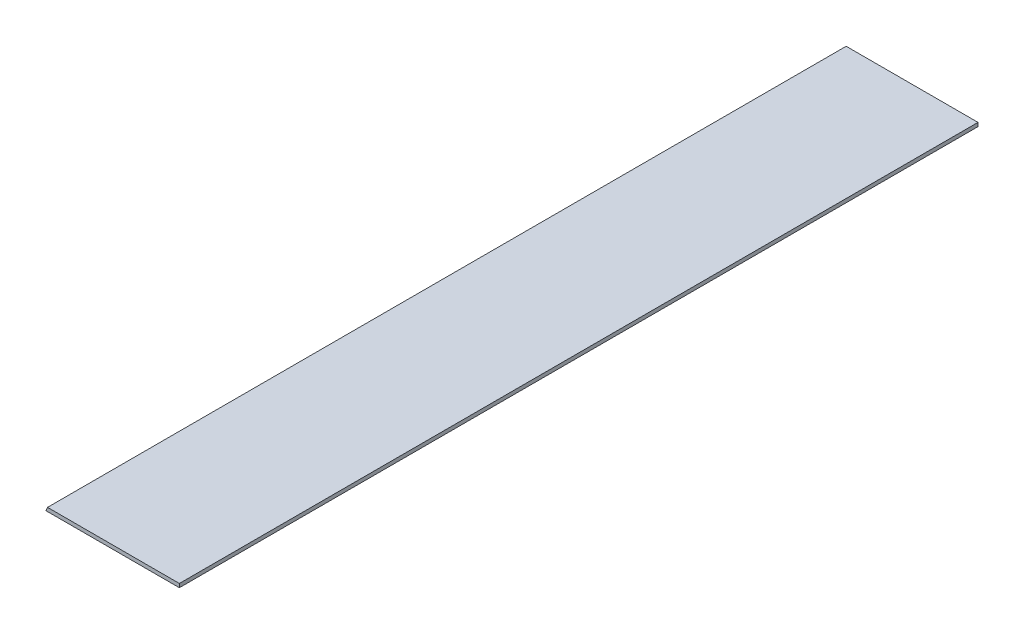
ISO-10303-21;
HEADER;
FILE_DESCRIPTION(('STEP AP214'),'2;1');
FILE_NAME('part.step','',(''),(''),'','','');
FILE_SCHEMA(('AUTOMOTIVE_DESIGN { 1 0 10303 214 1 1 1 1 }'));
ENDSEC;
DATA;
#1=APPLICATION_CONTEXT('core data for automotive mechanical design processes');
#2=APPLICATION_PROTOCOL_DEFINITION('international standard','automotive_design',2000,#1);
#3=PRODUCT_CONTEXT('',#1,'mechanical');
#4=PRODUCT('Part','Part','',(#3));
#5=PRODUCT_RELATED_PRODUCT_CATEGORY('part','',(#4));
#6=PRODUCT_DEFINITION_FORMATION('','',#4);
#7=PRODUCT_DEFINITION_CONTEXT('part definition',#1,'design');
#8=PRODUCT_DEFINITION('design','',#6,#7);
#9=PRODUCT_DEFINITION_SHAPE('','',#8);
#10=(LENGTH_UNIT() NAMED_UNIT(*) SI_UNIT(.MILLI.,.METRE.));
#11=(NAMED_UNIT(*) PLANE_ANGLE_UNIT() SI_UNIT($,.RADIAN.));
#12=(NAMED_UNIT(*) SI_UNIT($,.STERADIAN.) SOLID_ANGLE_UNIT());
#13=UNCERTAINTY_MEASURE_WITH_UNIT(LENGTH_MEASURE(1.E-05),#10,'distance_accuracy_value','');
#14=(GEOMETRIC_REPRESENTATION_CONTEXT(3) GLOBAL_UNCERTAINTY_ASSIGNED_CONTEXT((#13)) GLOBAL_UNIT_ASSIGNED_CONTEXT((#10,
#11,#12)) REPRESENTATION_CONTEXT('',''));
#15=CARTESIAN_POINT('',(0.,0.,0.));
#16=DIRECTION('',(0.,0.,1.));
#17=DIRECTION('',(1.,0.,0.));
#18=AXIS2_PLACEMENT_3D('',#15,#16,#17);
#19=CARTESIAN_POINT('',(84.836,0.,508.));
#20=DIRECTION('',(0.,1.,0.));
#21=DIRECTION('',(-1.,0.,0.));
#22=AXIS2_PLACEMENT_3D('',#19,#20,#21);
#23=PLANE('',#22);
#24=DIRECTION('',(1.,0.,0.));
#25=VECTOR('',#24,1.);
#26=CARTESIAN_POINT('',(84.836,0.,0.));
#27=LINE('',#26,#25);
#28=CARTESIAN_POINT('',(0.,0.,0.));
#29=VERTEX_POINT('',#28);
#30=CARTESIAN_POINT('',(84.836,0.,0.));
#31=VERTEX_POINT('',#30);
#32=EDGE_CURVE('E98',#29,#31,#27,.T.);
#33=ORIENTED_EDGE('',*,*,#32,.T.);
#34=DIRECTION('',(0.,0.,-1.));
#35=VECTOR('',#34,1.);
#36=CARTESIAN_POINT('',(84.836,0.,508.));
#37=LINE('',#36,#35);
#38=CARTESIAN_POINT('',(84.836,0.,508.));
#39=VERTEX_POINT('',#38);
#40=EDGE_CURVE('E11',#39,#31,#37,.T.);
#41=ORIENTED_EDGE('',*,*,#40,.F.);
#42=DIRECTION('',(1.,0.,0.));
#43=VECTOR('',#42,1.);
#44=CARTESIAN_POINT('',(84.836,0.,508.));
#45=LINE('',#44,#43);
#46=CARTESIAN_POINT('',(0.,0.,508.));
#47=VERTEX_POINT('',#46);
#48=EDGE_CURVE('E86',#47,#39,#45,.T.);
#49=ORIENTED_EDGE('',*,*,#48,.F.);
#50=DIRECTION('',(0.,0.,-1.));
#51=VECTOR('',#50,1.);
#52=CARTESIAN_POINT('',(0.,0.,508.));
#53=LINE('',#52,#51);
#54=EDGE_CURVE('E94',#47,#29,#53,.T.);
#55=ORIENTED_EDGE('',*,*,#54,.T.);
#56=EDGE_LOOP('',(#33,#41,#49,#55));
#57=FACE_BOUND('',#56,.T.);
#58=ADVANCED_FACE('F35',(#57),#23,.F.);
#59=CARTESIAN_POINT('',(84.836,2.3622,508.));
#60=DIRECTION('',(-1.,0.,0.));
#61=DIRECTION('',(0.,0.,1.));
#62=AXIS2_PLACEMENT_3D('',#59,#60,#61);
#63=PLANE('',#62);
#64=DIRECTION('',(0.,1.,0.));
#65=VECTOR('',#64,1.);
#66=CARTESIAN_POINT('',(84.836,2.3622,0.));
#67=LINE('',#66,#65);
#68=CARTESIAN_POINT('',(84.836,2.3622,0.));
#69=VERTEX_POINT('',#68);
#70=EDGE_CURVE('E90',#31,#69,#67,.T.);
#71=ORIENTED_EDGE('',*,*,#70,.T.);
#72=DIRECTION('',(0.,0.,-1.));
#73=VECTOR('',#72,1.);
#74=CARTESIAN_POINT('',(84.836,2.3622,508.));
#75=LINE('',#74,#73);
#76=CARTESIAN_POINT('',(84.836,2.3622,508.));
#77=VERTEX_POINT('',#76);
#78=EDGE_CURVE('E43',#77,#69,#75,.T.);
#79=ORIENTED_EDGE('',*,*,#78,.F.);
#80=DIRECTION('',(0.,1.,0.));
#81=VECTOR('',#80,1.);
#82=CARTESIAN_POINT('',(84.836,2.3622,508.));
#83=LINE('',#82,#81);
#84=EDGE_CURVE('E81',#39,#77,#83,.T.);
#85=ORIENTED_EDGE('',*,*,#84,.F.);
#86=ORIENTED_EDGE('',*,*,#40,.T.);
#87=EDGE_LOOP('',(#71,#79,#85,#86));
#88=FACE_BOUND('',#87,.T.);
#89=ADVANCED_FACE('F89',(#88),#63,.F.);
#90=CARTESIAN_POINT('',(0.978455277037737,2.3622,508.));
#91=DIRECTION('',(0.,-1.,0.));
#92=DIRECTION('',(1.,0.,0.));
#93=AXIS2_PLACEMENT_3D('',#90,#91,#92);
#94=PLANE('',#93);
#95=DIRECTION('',(-1.,0.,0.));
#96=VECTOR('',#95,1.);
#97=CARTESIAN_POINT('',(0.978455277037737,2.3622,0.));
#98=LINE('',#97,#96);
#99=CARTESIAN_POINT('',(0.978455277037737,2.3622,0.));
#100=VERTEX_POINT('',#99);
#101=EDGE_CURVE('E68',#69,#100,#98,.T.);
#102=ORIENTED_EDGE('',*,*,#101,.T.);
#103=DIRECTION('',(0.,0.,-1.));
#104=VECTOR('',#103,1.);
#105=CARTESIAN_POINT('',(0.978455277037737,2.3622,508.));
#106=LINE('',#105,#104);
#107=CARTESIAN_POINT('',(0.978455277037737,2.3622,508.));
#108=VERTEX_POINT('',#107);
#109=EDGE_CURVE('E91',#108,#100,#106,.T.);
#110=ORIENTED_EDGE('',*,*,#109,.F.);
#111=DIRECTION('',(-1.,0.,0.));
#112=VECTOR('',#111,1.);
#113=CARTESIAN_POINT('',(0.978455277037737,2.3622,508.));
#114=LINE('',#113,#112);
#115=EDGE_CURVE('E84',#77,#108,#114,.T.);
#116=ORIENTED_EDGE('',*,*,#115,.F.);
#117=ORIENTED_EDGE('',*,*,#78,.T.);
#118=EDGE_LOOP('',(#102,#110,#116,#117));
#119=FACE_BOUND('',#118,.T.);
#120=ADVANCED_FACE('F92',(#119),#94,.F.);
#121=CARTESIAN_POINT('',(0.,0.,508.));
#122=DIRECTION('',(0.923879532511285,-0.382683432365094,0.));
#123=DIRECTION('',(0.382683432365094,0.923879532511285,0.));
#124=AXIS2_PLACEMENT_3D('',#121,#122,#123);
#125=PLANE('',#124);
#126=DIRECTION('',(-0.382683432365094,-0.923879532511285,0.));
#127=VECTOR('',#126,1.);
#128=CARTESIAN_POINT('',(0.,0.,0.));
#129=LINE('',#128,#127);
#130=EDGE_CURVE('E74',#100,#29,#129,.T.);
#131=ORIENTED_EDGE('',*,*,#130,.T.);
#132=ORIENTED_EDGE('',*,*,#54,.F.);
#133=DIRECTION('',(-0.382683432365094,-0.923879532511285,0.));
#134=VECTOR('',#133,1.);
#135=CARTESIAN_POINT('',(0.,0.,508.));
#136=LINE('',#135,#134);
#137=EDGE_CURVE('E51',#108,#47,#136,.T.);
#138=ORIENTED_EDGE('',*,*,#137,.F.);
#139=ORIENTED_EDGE('',*,*,#109,.T.);
#140=EDGE_LOOP('',(#131,#132,#138,#139));
#141=FACE_BOUND('',#140,.T.);
#142=ADVANCED_FACE('F105',(#141),#125,.F.);
#143=CARTESIAN_POINT('',(0.,0.,508.));
#144=DIRECTION('',(0.,0.,1.));
#145=DIRECTION('',(1.,0.,0.));
#146=AXIS2_PLACEMENT_3D('',#143,#144,#145);
#147=PLANE('',#146);
#148=ORIENTED_EDGE('',*,*,#48,.T.);
#149=ORIENTED_EDGE('',*,*,#84,.T.);
#150=ORIENTED_EDGE('',*,*,#115,.T.);
#151=ORIENTED_EDGE('',*,*,#137,.T.);
#152=EDGE_LOOP('',(#148,#149,#150,#151));
#153=FACE_BOUND('',#152,.T.);
#154=ADVANCED_FACE('F82',(#153),#147,.T.);
#155=CARTESIAN_POINT('',(0.,0.,0.));
#156=DIRECTION('',(0.,0.,1.));
#157=DIRECTION('',(1.,0.,0.));
#158=AXIS2_PLACEMENT_3D('',#155,#156,#157);
#159=PLANE('',#158);
#160=ORIENTED_EDGE('',*,*,#32,.F.);
#161=ORIENTED_EDGE('',*,*,#130,.F.);
#162=ORIENTED_EDGE('',*,*,#101,.F.);
#163=ORIENTED_EDGE('',*,*,#70,.F.);
#164=EDGE_LOOP('',(#160,#161,#162,#163));
#165=FACE_BOUND('',#164,.T.);
#166=ADVANCED_FACE('F108',(#165),#159,.F.);
#167=CLOSED_SHELL('',(#58,#89,#120,#142,#154,#166));
#168=MANIFOLD_SOLID_BREP('B2',#167);
#169=ADVANCED_BREP_SHAPE_REPRESENTATION('',(#18,#168),#14);
#170=SHAPE_DEFINITION_REPRESENTATION(#9,#169);
ENDSEC;
END-ISO-10303-21;
